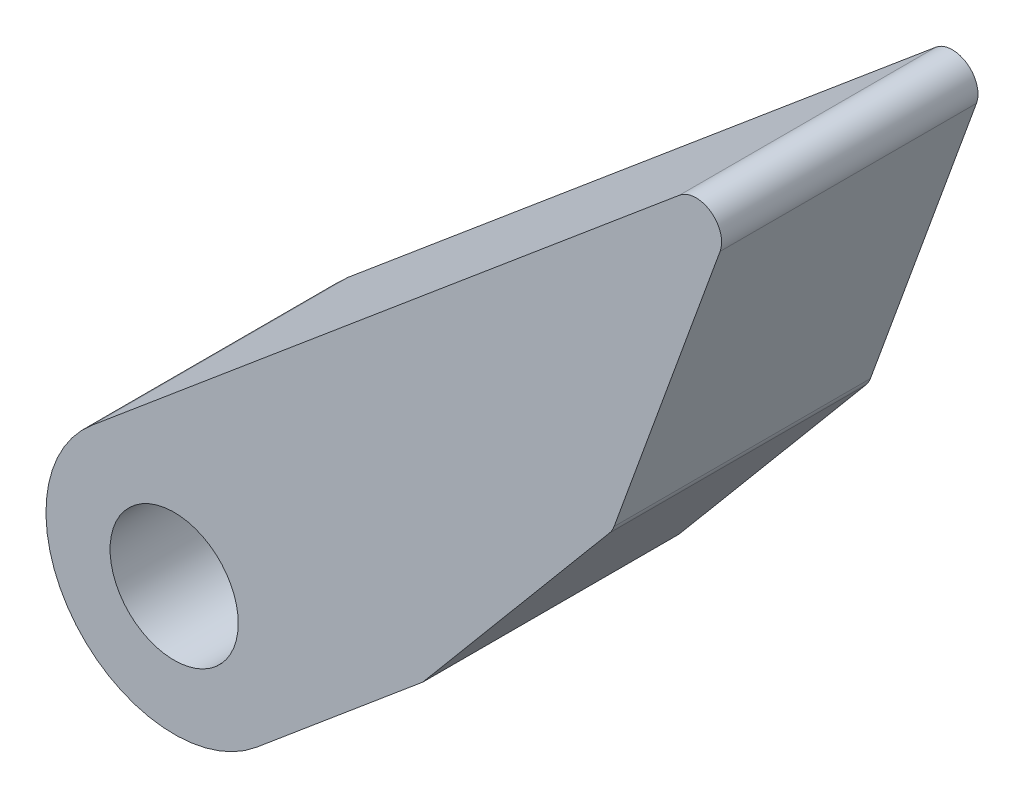
ISO-10303-21;
HEADER;
FILE_DESCRIPTION(('STEP AP214'),'2;1');
FILE_NAME('part.step','',(''),(''),'','','');
FILE_SCHEMA(('AUTOMOTIVE_DESIGN { 1 0 10303 214 1 1 1 1 }'));
ENDSEC;
DATA;
#1=APPLICATION_CONTEXT('core data for automotive mechanical design processes');
#2=APPLICATION_PROTOCOL_DEFINITION('international standard','automotive_design',2000,#1);
#3=PRODUCT_CONTEXT('',#1,'mechanical');
#4=PRODUCT('Part','Part','',(#3));
#5=PRODUCT_RELATED_PRODUCT_CATEGORY('part','',(#4));
#6=PRODUCT_DEFINITION_FORMATION('','',#4);
#7=PRODUCT_DEFINITION_CONTEXT('part definition',#1,'design');
#8=PRODUCT_DEFINITION('design','',#6,#7);
#9=PRODUCT_DEFINITION_SHAPE('','',#8);
#10=(LENGTH_UNIT() NAMED_UNIT(*) SI_UNIT(.MILLI.,.METRE.));
#11=(NAMED_UNIT(*) PLANE_ANGLE_UNIT() SI_UNIT($,.RADIAN.));
#12=(NAMED_UNIT(*) SI_UNIT($,.STERADIAN.) SOLID_ANGLE_UNIT());
#13=UNCERTAINTY_MEASURE_WITH_UNIT(LENGTH_MEASURE(1.E-05),#10,'distance_accuracy_value','');
#14=(GEOMETRIC_REPRESENTATION_CONTEXT(3) GLOBAL_UNCERTAINTY_ASSIGNED_CONTEXT((#13)) GLOBAL_UNIT_ASSIGNED_CONTEXT((#10,
#11,#12)) REPRESENTATION_CONTEXT('',''));
#15=CARTESIAN_POINT('',(0.,0.,0.));
#16=DIRECTION('',(0.,0.,1.));
#17=DIRECTION('',(1.,0.,0.));
#18=AXIS2_PLACEMENT_3D('',#15,#16,#17);
#19=CARTESIAN_POINT('',(-35.0111626792796,-17.0312528459638,10.));
#20=DIRECTION('',(0.,0.,-1.));
#21=DIRECTION('',(-1.,0.,0.));
#22=AXIS2_PLACEMENT_3D('',#19,#20,#21);
#23=PLANE('',#22);
#24=CARTESIAN_POINT('',(-35.0111626792796,-17.0312528459638,10.));
#25=DIRECTION('',(0.,0.,1.));
#26=DIRECTION('',(-1.,0.,0.));
#27=AXIS2_PLACEMENT_3D('',#24,#25,#26);
#28=CIRCLE('',#27,5.);
#29=CARTESIAN_POINT('',(-38.2251007277124,-13.2010306303689,10.));
#30=VERTEX_POINT('',#29);
#31=CARTESIAN_POINT('',(-31.797224630847,-20.8614750615587,10.));
#32=VERTEX_POINT('',#31);
#33=EDGE_CURVE('E89',#30,#32,#28,.T.);
#34=ORIENTED_EDGE('',*,*,#33,.T.);
#35=DIRECTION('',(0.766044443118976,0.642787609686542,0.));
#36=VECTOR('',#35,1.);
#37=CARTESIAN_POINT('',(-25.3155050884462,-15.4226665841357,10.));
#38=LINE('',#37,#36);
#39=CARTESIAN_POINT('',(-25.3155050884462,-15.4226665841357,10.));
#40=VERTEX_POINT('',#39);
#41=EDGE_CURVE('E157',#32,#40,#38,.T.);
#42=ORIENTED_EDGE('',*,*,#41,.T.);
#43=DIRECTION('',(0.642787609686543,0.766044443118975,0.));
#44=VECTOR('',#43,1.);
#45=CARTESIAN_POINT('',(-18.0255132597122,-6.73479263225946,10.));
#46=LINE('',#45,#44);
#47=CARTESIAN_POINT('',(-18.0255132597122,-6.73479263225946,10.));
#48=VERTEX_POINT('',#47);
#49=EDGE_CURVE('E149',#40,#48,#46,.T.);
#50=ORIENTED_EDGE('',*,*,#49,.T.);
#51=CARTESIAN_POINT('',(-18.7915577028311,-6.09200502257292,10.));
#52=DIRECTION('',(0.,0.,1.));
#53=DIRECTION('',(1.,0.,0.));
#54=AXIS2_PLACEMENT_3D('',#51,#52,#53);
#55=CIRCLE('',#54,1.);
#56=CARTESIAN_POINT('',(-17.8518650820452,-6.43402516589858,10.));
#57=VERTEX_POINT('',#56);
#58=EDGE_CURVE('E106',#48,#57,#55,.T.);
#59=ORIENTED_EDGE('',*,*,#58,.T.);
#60=DIRECTION('',(0.342020143325672,0.939692620785907,0.));
#61=VECTOR('',#60,1.);
#62=CARTESIAN_POINT('',(-13.7162867201519,4.92838299978821,10.));
#63=LINE('',#62,#61);
#64=CARTESIAN_POINT('',(-13.7162867201519,4.92838299978821,10.));
#65=VERTEX_POINT('',#64);
#66=EDGE_CURVE('E100',#57,#65,#63,.T.);
#67=ORIENTED_EDGE('',*,*,#66,.T.);
#68=CARTESIAN_POINT('',(-14.6559793409378,5.27040314311393,10.));
#69=DIRECTION('',(0.,0.,1.));
#70=DIRECTION('',(1.,0.,0.));
#71=AXIS2_PLACEMENT_3D('',#68,#69,#70);
#72=CIRCLE('',#71,1.);
#73=CARTESIAN_POINT('',(-15.2987669506244,6.03644758623287,10.));
#74=VERTEX_POINT('',#73);
#75=EDGE_CURVE('E104',#65,#74,#72,.T.);
#76=ORIENTED_EDGE('',*,*,#75,.T.);
#77=DIRECTION('',(-0.766044443118977,-0.642787609686541,0.));
#78=VECTOR('',#77,1.);
#79=CARTESIAN_POINT('',(-38.2251007277124,-13.2010306303689,10.));
#80=LINE('',#79,#78);
#81=EDGE_CURVE('E50',#74,#30,#80,.T.);
#82=ORIENTED_EDGE('',*,*,#81,.T.);
#83=EDGE_LOOP('',(#34,#42,#50,#59,#67,#76,#82));
#84=FACE_BOUND('',#83,.T.);
#85=CARTESIAN_POINT('',(-35.0111626792797,-17.0312528459638,10.));
#86=DIRECTION('',(0.,0.,1.));
#87=DIRECTION('',(1.,0.,0.));
#88=AXIS2_PLACEMENT_3D('',#85,#86,#87);
#89=CIRCLE('',#88,2.5);
#90=CARTESIAN_POINT('',(-32.5111626792797,-17.0312528459638,10.));
#91=VERTEX_POINT('',#90);
#92=EDGE_CURVE('E126',#91,#91,#89,.T.);
#93=ORIENTED_EDGE('',*,*,#92,.F.);
#94=EDGE_LOOP('',(#93));
#95=FACE_BOUND('',#94,.T.);
#96=ADVANCED_FACE('F33',(#84,#95),#23,.F.);
#97=CARTESIAN_POINT('',(-35.0111626792796,-17.0312528459638,0.));
#98=DIRECTION('',(0.,0.,-1.));
#99=DIRECTION('',(-1.,0.,0.));
#100=AXIS2_PLACEMENT_3D('',#97,#98,#99);
#101=PLANE('',#100);
#102=CARTESIAN_POINT('',(-35.0111626792797,-17.0312528459638,0.));
#103=DIRECTION('',(0.,0.,1.));
#104=DIRECTION('',(1.,0.,0.));
#105=AXIS2_PLACEMENT_3D('',#102,#103,#104);
#106=CIRCLE('',#105,5.);
#107=CARTESIAN_POINT('',(-38.2251007277124,-13.2010306303689,0.));
#108=VERTEX_POINT('',#107);
#109=CARTESIAN_POINT('',(-31.797224630847,-20.8614750615587,0.));
#110=VERTEX_POINT('',#109);
#111=EDGE_CURVE('E83',#108,#110,#106,.T.);
#112=ORIENTED_EDGE('',*,*,#111,.F.);
#113=DIRECTION('',(-0.766044443118977,-0.642787609686541,0.));
#114=VECTOR('',#113,1.);
#115=CARTESIAN_POINT('',(-38.2251007277124,-13.2010306303689,0.));
#116=LINE('',#115,#114);
#117=CARTESIAN_POINT('',(-15.2987669506244,6.03644758623287,0.));
#118=VERTEX_POINT('',#117);
#119=EDGE_CURVE('E134',#118,#108,#116,.T.);
#120=ORIENTED_EDGE('',*,*,#119,.F.);
#121=CARTESIAN_POINT('',(-14.6559793409378,5.27040314311393,0.));
#122=DIRECTION('',(0.,0.,1.));
#123=DIRECTION('',(1.,0.,0.));
#124=AXIS2_PLACEMENT_3D('',#121,#122,#123);
#125=CIRCLE('',#124,1.);
#126=CARTESIAN_POINT('',(-13.7162867201519,4.92838299978821,0.));
#127=VERTEX_POINT('',#126);
#128=EDGE_CURVE('E76',#127,#118,#125,.T.);
#129=ORIENTED_EDGE('',*,*,#128,.F.);
#130=DIRECTION('',(0.342020143325672,0.939692620785907,0.));
#131=VECTOR('',#130,1.);
#132=CARTESIAN_POINT('',(-13.7162867201519,4.92838299978821,0.));
#133=LINE('',#132,#131);
#134=CARTESIAN_POINT('',(-17.8518650820452,-6.43402516589858,0.));
#135=VERTEX_POINT('',#134);
#136=EDGE_CURVE('E114',#135,#127,#133,.T.);
#137=ORIENTED_EDGE('',*,*,#136,.F.);
#138=CARTESIAN_POINT('',(-18.7915577028311,-6.09200502257292,0.));
#139=DIRECTION('',(0.,0.,1.));
#140=DIRECTION('',(1.,0.,0.));
#141=AXIS2_PLACEMENT_3D('',#138,#139,#140);
#142=CIRCLE('',#141,1.);
#143=CARTESIAN_POINT('',(-18.0255132597122,-6.73479263225946,0.));
#144=VERTEX_POINT('',#143);
#145=EDGE_CURVE('E130',#144,#135,#142,.T.);
#146=ORIENTED_EDGE('',*,*,#145,.F.);
#147=DIRECTION('',(0.642787609686543,0.766044443118975,0.));
#148=VECTOR('',#147,1.);
#149=CARTESIAN_POINT('',(-18.0255132597122,-6.73479263225946,0.));
#150=LINE('',#149,#148);
#151=CARTESIAN_POINT('',(-25.3155050884462,-15.4226665841357,0.));
#152=VERTEX_POINT('',#151);
#153=EDGE_CURVE('E128',#152,#144,#150,.T.);
#154=ORIENTED_EDGE('',*,*,#153,.F.);
#155=DIRECTION('',(0.766044443118976,0.642787609686542,0.));
#156=VECTOR('',#155,1.);
#157=CARTESIAN_POINT('',(-25.3155050884462,-15.4226665841357,0.));
#158=LINE('',#157,#156);
#159=EDGE_CURVE('E125',#110,#152,#158,.T.);
#160=ORIENTED_EDGE('',*,*,#159,.F.);
#161=EDGE_LOOP('',(#112,#120,#129,#137,#146,#154,#160));
#162=FACE_BOUND('',#161,.T.);
#163=CARTESIAN_POINT('',(-35.0111626792797,-17.0312528459638,0.));
#164=DIRECTION('',(0.,0.,1.));
#165=DIRECTION('',(1.,0.,0.));
#166=AXIS2_PLACEMENT_3D('',#163,#164,#165);
#167=CIRCLE('',#166,2.5);
#168=CARTESIAN_POINT('',(-32.5111626792797,-17.0312528459638,0.));
#169=VERTEX_POINT('',#168);
#170=EDGE_CURVE('E162',#169,#169,#167,.T.);
#171=ORIENTED_EDGE('',*,*,#170,.T.);
#172=EDGE_LOOP('',(#171));
#173=FACE_BOUND('',#172,.T.);
#174=ADVANCED_FACE('F153',(#162,#173),#101,.T.);
#175=CARTESIAN_POINT('',(-35.0111626792797,-17.0312528459638,10.));
#176=DIRECTION('',(0.,0.,-1.));
#177=DIRECTION('',(-1.,0.,0.));
#178=AXIS2_PLACEMENT_3D('',#175,#176,#177);
#179=CYLINDRICAL_SURFACE('',#178,5.);
#180=ORIENTED_EDGE('',*,*,#111,.T.);
#181=DIRECTION('',(0.,0.,-1.));
#182=VECTOR('',#181,1.);
#183=CARTESIAN_POINT('',(-31.797224630847,-20.8614750615587,10.));
#184=LINE('',#183,#182);
#185=EDGE_CURVE('E11',#32,#110,#184,.T.);
#186=ORIENTED_EDGE('',*,*,#185,.F.);
#187=ORIENTED_EDGE('',*,*,#33,.F.);
#188=DIRECTION('',(0.,0.,-1.));
#189=VECTOR('',#188,1.);
#190=CARTESIAN_POINT('',(-38.2251007277124,-13.2010306303689,10.));
#191=LINE('',#190,#189);
#192=EDGE_CURVE('E120',#30,#108,#191,.T.);
#193=ORIENTED_EDGE('',*,*,#192,.T.);
#194=EDGE_LOOP('',(#180,#186,#187,#193));
#195=FACE_BOUND('',#194,.T.);
#196=ADVANCED_FACE('F35',(#195),#179,.T.);
#197=CARTESIAN_POINT('',(-25.3155050884462,-15.4226665841357,10.));
#198=DIRECTION('',(-0.642787609686542,0.766044443118976,0.));
#199=DIRECTION('',(-0.766044443118976,-0.642787609686542,0.));
#200=AXIS2_PLACEMENT_3D('',#197,#198,#199);
#201=PLANE('',#200);
#202=ORIENTED_EDGE('',*,*,#159,.T.);
#203=DIRECTION('',(0.,0.,-1.));
#204=VECTOR('',#203,1.);
#205=CARTESIAN_POINT('',(-25.3155050884462,-15.4226665841357,10.));
#206=LINE('',#205,#204);
#207=EDGE_CURVE('E42',#40,#152,#206,.T.);
#208=ORIENTED_EDGE('',*,*,#207,.F.);
#209=ORIENTED_EDGE('',*,*,#41,.F.);
#210=ORIENTED_EDGE('',*,*,#185,.T.);
#211=EDGE_LOOP('',(#202,#208,#209,#210));
#212=FACE_BOUND('',#211,.T.);
#213=ADVANCED_FACE('F189',(#212),#201,.F.);
#214=CARTESIAN_POINT('',(-18.0255132597122,-6.73479263225946,10.));
#215=DIRECTION('',(-0.766044443118975,0.642787609686543,0.));
#216=DIRECTION('',(-0.642787609686543,-0.766044443118975,0.));
#217=AXIS2_PLACEMENT_3D('',#214,#215,#216);
#218=PLANE('',#217);
#219=ORIENTED_EDGE('',*,*,#153,.T.);
#220=DIRECTION('',(0.,0.,-1.));
#221=VECTOR('',#220,1.);
#222=CARTESIAN_POINT('',(-18.0255132597122,-6.73479263225946,10.));
#223=LINE('',#222,#221);
#224=EDGE_CURVE('E140',#48,#144,#223,.T.);
#225=ORIENTED_EDGE('',*,*,#224,.F.);
#226=ORIENTED_EDGE('',*,*,#49,.F.);
#227=ORIENTED_EDGE('',*,*,#207,.T.);
#228=EDGE_LOOP('',(#219,#225,#226,#227));
#229=FACE_BOUND('',#228,.T.);
#230=ADVANCED_FACE('F147',(#229),#218,.F.);
#231=CARTESIAN_POINT('',(-18.7915577028311,-6.09200502257292,10.));
#232=DIRECTION('',(0.,0.,-1.));
#233=DIRECTION('',(-1.,0.,0.));
#234=AXIS2_PLACEMENT_3D('',#231,#232,#233);
#235=CYLINDRICAL_SURFACE('',#234,1.);
#236=ORIENTED_EDGE('',*,*,#145,.T.);
#237=DIRECTION('',(0.,0.,-1.));
#238=VECTOR('',#237,1.);
#239=CARTESIAN_POINT('',(-17.8518650820452,-6.43402516589858,10.));
#240=LINE('',#239,#238);
#241=EDGE_CURVE('E115',#57,#135,#240,.T.);
#242=ORIENTED_EDGE('',*,*,#241,.F.);
#243=ORIENTED_EDGE('',*,*,#58,.F.);
#244=ORIENTED_EDGE('',*,*,#224,.T.);
#245=EDGE_LOOP('',(#236,#242,#243,#244));
#246=FACE_BOUND('',#245,.T.);
#247=ADVANCED_FACE('F156',(#246),#235,.T.);
#248=CARTESIAN_POINT('',(-13.7162867201519,4.92838299978821,10.));
#249=DIRECTION('',(-0.939692620785907,0.342020143325672,0.));
#250=DIRECTION('',(-0.342020143325672,-0.939692620785907,0.));
#251=AXIS2_PLACEMENT_3D('',#248,#249,#250);
#252=PLANE('',#251);
#253=ORIENTED_EDGE('',*,*,#136,.T.);
#254=DIRECTION('',(0.,0.,-1.));
#255=VECTOR('',#254,1.);
#256=CARTESIAN_POINT('',(-13.7162867201519,4.92838299978821,10.));
#257=LINE('',#256,#255);
#258=EDGE_CURVE('E111',#65,#127,#257,.T.);
#259=ORIENTED_EDGE('',*,*,#258,.F.);
#260=ORIENTED_EDGE('',*,*,#66,.F.);
#261=ORIENTED_EDGE('',*,*,#241,.T.);
#262=EDGE_LOOP('',(#253,#259,#260,#261));
#263=FACE_BOUND('',#262,.T.);
#264=ADVANCED_FACE('F112',(#263),#252,.F.);
#265=CARTESIAN_POINT('',(-14.6559793409378,5.27040314311393,10.));
#266=DIRECTION('',(0.,0.,-1.));
#267=DIRECTION('',(-1.,0.,0.));
#268=AXIS2_PLACEMENT_3D('',#265,#266,#267);
#269=CYLINDRICAL_SURFACE('',#268,1.);
#270=ORIENTED_EDGE('',*,*,#128,.T.);
#271=DIRECTION('',(0.,0.,-1.));
#272=VECTOR('',#271,1.);
#273=CARTESIAN_POINT('',(-15.2987669506244,6.03644758623287,10.));
#274=LINE('',#273,#272);
#275=EDGE_CURVE('E116',#74,#118,#274,.T.);
#276=ORIENTED_EDGE('',*,*,#275,.F.);
#277=ORIENTED_EDGE('',*,*,#75,.F.);
#278=ORIENTED_EDGE('',*,*,#258,.T.);
#279=EDGE_LOOP('',(#270,#276,#277,#278));
#280=FACE_BOUND('',#279,.T.);
#281=ADVANCED_FACE('F118',(#280),#269,.T.);
#282=CARTESIAN_POINT('',(-38.2251007277124,-13.2010306303689,10.));
#283=DIRECTION('',(0.642787609686541,-0.766044443118977,0.));
#284=DIRECTION('',(0.766044443118977,0.642787609686541,0.));
#285=AXIS2_PLACEMENT_3D('',#282,#283,#284);
#286=PLANE('',#285);
#287=ORIENTED_EDGE('',*,*,#119,.T.);
#288=ORIENTED_EDGE('',*,*,#192,.F.);
#289=ORIENTED_EDGE('',*,*,#81,.F.);
#290=ORIENTED_EDGE('',*,*,#275,.T.);
#291=EDGE_LOOP('',(#287,#288,#289,#290));
#292=FACE_BOUND('',#291,.T.);
#293=ADVANCED_FACE('F178',(#292),#286,.F.);
#294=CARTESIAN_POINT('',(-35.0111626792797,-17.0312528459638,10.));
#295=DIRECTION('',(0.,0.,-1.));
#296=DIRECTION('',(-1.,0.,0.));
#297=AXIS2_PLACEMENT_3D('',#294,#295,#296);
#298=CYLINDRICAL_SURFACE('',#297,2.5);
#299=ORIENTED_EDGE('',*,*,#92,.T.);
#300=EDGE_LOOP('',(#299));
#301=FACE_BOUND('',#300,.T.);
#302=ORIENTED_EDGE('',*,*,#170,.F.);
#303=EDGE_LOOP('',(#302));
#304=FACE_BOUND('',#303,.T.);
#305=ADVANCED_FACE('F168',(#301,#304),#298,.F.);
#306=CLOSED_SHELL('',(#96,#174,#196,#213,#230,#247,#264,#281,#293,#305));
#307=MANIFOLD_SOLID_BREP('B2',#306);
#308=ADVANCED_BREP_SHAPE_REPRESENTATION('',(#18,#307),#14);
#309=SHAPE_DEFINITION_REPRESENTATION(#9,#308);
ENDSEC;
END-ISO-10303-21;
